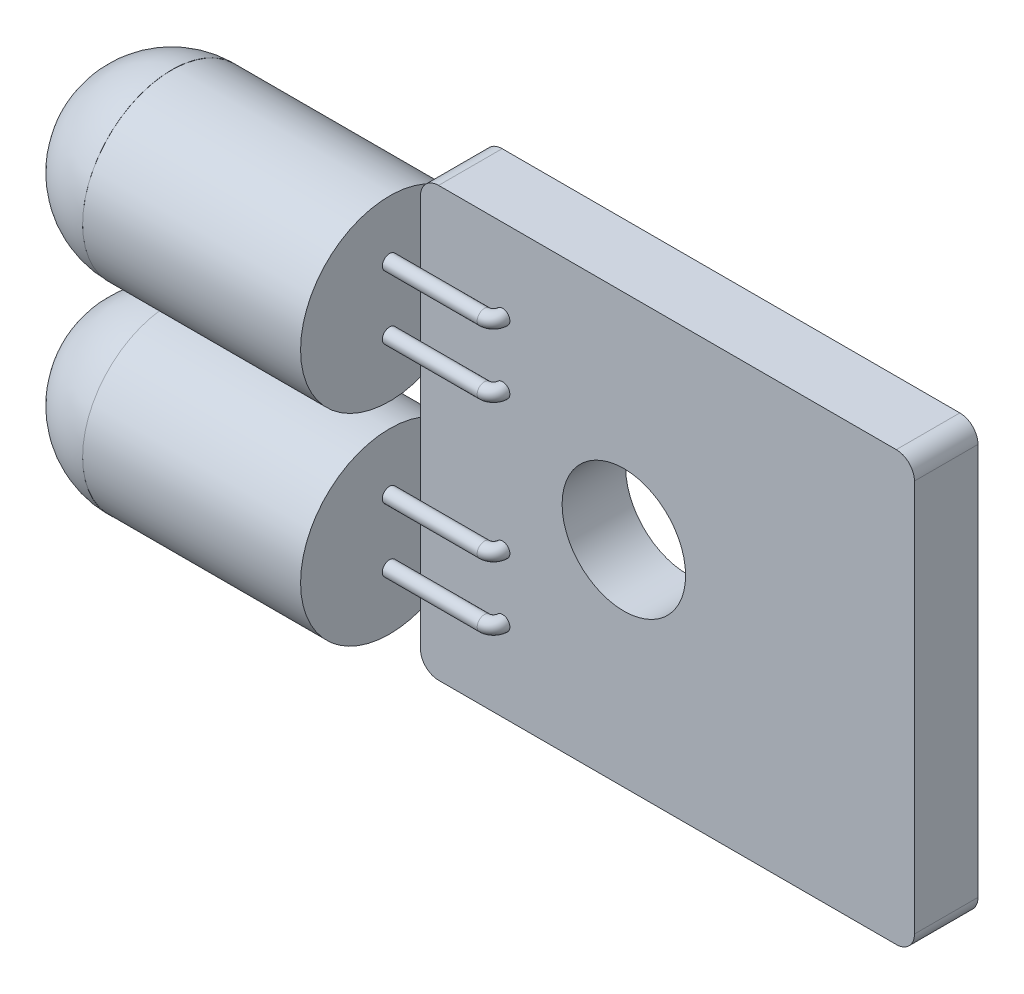
ISO-10303-21;
HEADER;
FILE_DESCRIPTION(('STEP AP214'),'2;1');
FILE_NAME('part.step','',(''),(''),'','','');
FILE_SCHEMA(('AUTOMOTIVE_DESIGN { 1 0 10303 214 1 1 1 1 }'));
ENDSEC;
DATA;
#1=APPLICATION_CONTEXT('core data for automotive mechanical design processes');
#2=APPLICATION_PROTOCOL_DEFINITION('international standard','automotive_design',2000,#1);
#3=PRODUCT_CONTEXT('',#1,'mechanical');
#4=PRODUCT('Part','Part','',(#3));
#5=PRODUCT_RELATED_PRODUCT_CATEGORY('part','',(#4));
#6=PRODUCT_DEFINITION_FORMATION('','',#4);
#7=PRODUCT_DEFINITION_CONTEXT('part definition',#1,'design');
#8=PRODUCT_DEFINITION('design','',#6,#7);
#9=PRODUCT_DEFINITION_SHAPE('','',#8);
#10=(LENGTH_UNIT() NAMED_UNIT(*) SI_UNIT(.MILLI.,.METRE.));
#11=(NAMED_UNIT(*) PLANE_ANGLE_UNIT() SI_UNIT($,.RADIAN.));
#12=(NAMED_UNIT(*) SI_UNIT($,.STERADIAN.) SOLID_ANGLE_UNIT());
#13=UNCERTAINTY_MEASURE_WITH_UNIT(LENGTH_MEASURE(1.E-05),#10,'distance_accuracy_value','');
#14=(GEOMETRIC_REPRESENTATION_CONTEXT(3) GLOBAL_UNCERTAINTY_ASSIGNED_CONTEXT((#13)) GLOBAL_UNIT_ASSIGNED_CONTEXT((#10,
#11,#12)) REPRESENTATION_CONTEXT('',''));
#15=CARTESIAN_POINT('',(0.,0.,0.));
#16=DIRECTION('',(0.,0.,1.));
#17=DIRECTION('',(1.,0.,0.));
#18=AXIS2_PLACEMENT_3D('',#15,#16,#17);
#19=CARTESIAN_POINT('',(-6.6,-3.12,-0.450000000000001));
#20=DIRECTION('',(-1.,0.,0.));
#21=DIRECTION('',(0.,-1.,0.));
#22=AXIS2_PLACEMENT_3D('',#19,#20,#21);
#23=PLANE('',#22);
#24=CARTESIAN_POINT('',(-6.6,-3.12,2.));
#25=DIRECTION('',(1.,0.,0.));
#26=DIRECTION('',(0.,1.,0.));
#27=AXIS2_PLACEMENT_3D('',#24,#25,#26);
#28=CIRCLE('',#27,2.45);
#29=CARTESIAN_POINT('',(-6.6,-0.67,2.));
#30=VERTEX_POINT('',#29);
#31=EDGE_CURVE('E12',#30,#30,#28,.T.);
#32=ORIENTED_EDGE('',*,*,#31,.T.);
#33=EDGE_LOOP('',(#32));
#34=FACE_BOUND('',#33,.T.);
#35=ADVANCED_FACE('F73',(#34),#23,.F.);
#36=CARTESIAN_POINT('',(-6.6,-3.12,2.));
#37=DIRECTION('',(1.,0.,0.));
#38=DIRECTION('',(0.,0.,-1.));
#39=AXIS2_PLACEMENT_3D('',#36,#37,#38);
#40=SPHERICAL_SURFACE('',#39,2.45);
#41=ORIENTED_EDGE('',*,*,#31,.F.);
#42=EDGE_LOOP('',(#41));
#43=FACE_BOUND('',#42,.T.);
#44=ADVANCED_FACE('F81',(#43),#40,.T.);
#45=CLOSED_SHELL('',(#35,#44));
#46=MANIFOLD_SOLID_BREP('B2',#45);
#47=CARTESIAN_POINT('',(-6.6,-8.675,2.));
#48=DIRECTION('',(1.,0.,0.));
#49=DIRECTION('',(0.,0.,-1.));
#50=AXIS2_PLACEMENT_3D('',#47,#48,#49);
#51=CYLINDRICAL_SURFACE('',#50,2.45);
#52=CARTESIAN_POINT('',(-6.6,-8.675,2.));
#53=DIRECTION('',(-1.,0.,0.));
#54=DIRECTION('',(0.,0.,1.));
#55=AXIS2_PLACEMENT_3D('',#52,#53,#54);
#56=CIRCLE('',#55,2.45);
#57=CARTESIAN_POINT('',(-6.6,-8.67750000000022,-0.449998724489465));
#58=VERTEX_POINT('',#57);
#59=CARTESIAN_POINT('',(-6.6,-8.67750000000022,4.44999872448946));
#60=VERTEX_POINT('',#59);
#61=EDGE_CURVE('E273',#58,#60,#56,.T.);
#62=ORIENTED_EDGE('',*,*,#61,.F.);
#63=EDGE_CURVE('E268',#60,#58,#56,.T.);
#64=ORIENTED_EDGE('',*,*,#63,.F.);
#65=EDGE_LOOP('',(#62,#64));
#66=FACE_BOUND('',#65,.T.);
#67=CARTESIAN_POINT('',(-0.6,-8.675,2.));
#68=DIRECTION('',(-1.,0.,0.));
#69=DIRECTION('',(0.,0.,1.));
#70=AXIS2_PLACEMENT_3D('',#67,#68,#69);
#71=CIRCLE('',#70,2.45);
#72=CARTESIAN_POINT('',(-0.6,-8.675,4.45));
#73=VERTEX_POINT('',#72);
#74=EDGE_CURVE('E269',#73,#73,#71,.T.);
#75=ORIENTED_EDGE('',*,*,#74,.T.);
#76=EDGE_LOOP('',(#75));
#77=FACE_BOUND('',#76,.T.);
#78=ADVANCED_FACE('F123',(#66,#77),#51,.T.);
#79=CARTESIAN_POINT('',(-6.6,-8.675,2.));
#80=DIRECTION('',(-1.,0.,0.));
#81=DIRECTION('',(0.,0.,1.));
#82=AXIS2_PLACEMENT_3D('',#79,#80,#81);
#83=PLANE('',#82);
#84=ORIENTED_EDGE('',*,*,#63,.T.);
#85=CARTESIAN_POINT('',(-6.6,-8.68,2.));
#86=DIRECTION('',(-1.,0.,0.));
#87=DIRECTION('',(0.,-1.,0.));
#88=AXIS2_PLACEMENT_3D('',#85,#86,#87);
#89=CIRCLE('',#88,2.45);
#90=EDGE_CURVE('E265',#60,#58,#89,.T.);
#91=ORIENTED_EDGE('',*,*,#90,.F.);
#92=EDGE_LOOP('',(#84,#91));
#93=FACE_BOUND('',#92,.T.);
#94=ADVANCED_FACE('F347',(#93),#83,.T.);
#95=CARTESIAN_POINT('',(-0.6,-8.675,2.));
#96=DIRECTION('',(-1.,0.,0.));
#97=DIRECTION('',(0.,0.,1.));
#98=AXIS2_PLACEMENT_3D('',#95,#96,#97);
#99=PLANE('',#98);
#100=CARTESIAN_POINT('',(-0.599999999999999,-9.55,2.));
#101=DIRECTION('',(1.,0.,0.));
#102=DIRECTION('',(0.,0.,1.));
#103=AXIS2_PLACEMENT_3D('',#100,#101,#102);
#104=CIRCLE('',#103,0.2);
#105=CARTESIAN_POINT('',(-0.599999999999999,-9.55,2.2));
#106=VERTEX_POINT('',#105);
#107=EDGE_CURVE('E249',#106,#106,#104,.T.);
#108=ORIENTED_EDGE('',*,*,#107,.F.);
#109=EDGE_LOOP('',(#108));
#110=FACE_BOUND('',#109,.T.);
#111=CARTESIAN_POINT('',(-0.599999999999999,-7.8,2.));
#112=DIRECTION('',(1.,0.,0.));
#113=DIRECTION('',(0.,0.,1.));
#114=AXIS2_PLACEMENT_3D('',#111,#112,#113);
#115=CIRCLE('',#114,0.2);
#116=CARTESIAN_POINT('',(-0.599999999999999,-7.8,2.2));
#117=VERTEX_POINT('',#116);
#118=EDGE_CURVE('E258',#117,#117,#115,.T.);
#119=ORIENTED_EDGE('',*,*,#118,.F.);
#120=EDGE_LOOP('',(#119));
#121=FACE_BOUND('',#120,.T.);
#122=ORIENTED_EDGE('',*,*,#74,.F.);
#123=EDGE_LOOP('',(#122));
#124=FACE_BOUND('',#123,.T.);
#125=ADVANCED_FACE('F353',(#110,#121,#124),#99,.F.);
#126=CARTESIAN_POINT('',(-6.6,-8.68,-0.450000000000001));
#127=DIRECTION('',(-1.,0.,0.));
#128=DIRECTION('',(0.,1.,0.));
#129=AXIS2_PLACEMENT_3D('',#126,#127,#128);
#130=PLANE('',#129);
#131=EDGE_CURVE('E264',#58,#60,#89,.T.);
#132=ORIENTED_EDGE('',*,*,#131,.F.);
#133=ORIENTED_EDGE('',*,*,#61,.T.);
#134=EDGE_LOOP('',(#132,#133));
#135=FACE_BOUND('',#134,.T.);
#136=ADVANCED_FACE('F363',(#135),#130,.F.);
#137=CARTESIAN_POINT('',(-6.6,-8.68,2.));
#138=DIRECTION('',(1.,0.,0.));
#139=DIRECTION('',(0.,0.,-1.));
#140=AXIS2_PLACEMENT_3D('',#137,#138,#139);
#141=SPHERICAL_SURFACE('',#140,2.45);
#142=ORIENTED_EDGE('',*,*,#90,.T.);
#143=ORIENTED_EDGE('',*,*,#131,.T.);
#144=EDGE_LOOP('',(#142,#143));
#145=FACE_BOUND('',#144,.T.);
#146=ADVANCED_FACE('F360',(#145),#141,.T.);
#147=CARTESIAN_POINT('',(2.01207420711359,-7.8,1.75));
#148=DIRECTION('',(0.,1.,0.));
#149=DIRECTION('',(1.,0.,0.));
#150=AXIS2_PLACEMENT_3D('',#147,#148,#149);
#151=TOROIDAL_SURFACE('',#150,0.25,0.2);
#152=CARTESIAN_POINT('',(2.01207420711359,-7.8,2.));
#153=DIRECTION('',(1.,0.,0.));
#154=DIRECTION('',(0.,0.,1.));
#155=AXIS2_PLACEMENT_3D('',#152,#153,#154);
#156=CIRCLE('',#155,0.2);
#157=CARTESIAN_POINT('',(2.01207420711359,-7.8,2.2));
#158=VERTEX_POINT('',#157);
#159=EDGE_CURVE('E261',#158,#158,#156,.T.);
#160=CARTESIAN_POINT('',(2.26207420711359,-7.8,1.75));
#161=DIRECTION('',(0.,0.,-1.));
#162=DIRECTION('',(1.,0.,0.));
#163=AXIS2_PLACEMENT_3D('',#160,#161,#162);
#164=CIRCLE('',#163,0.2);
#165=CARTESIAN_POINT('',(2.46207420711359,-7.8,1.75));
#166=VERTEX_POINT('',#165);
#167=EDGE_CURVE('E255',#166,#166,#164,.T.);
#168=CARTESIAN_POINT('',(2.01207420711359,-7.8,1.75));
#169=DIRECTION('',(0.,1.,0.));
#170=DIRECTION('',(1.,0.,0.));
#171=AXIS2_PLACEMENT_3D('',#168,#169,#170);
#172=CIRCLE('',#171,0.45);
#173=EDGE_CURVE('',#158,#166,#172,.T.);
#174=ORIENTED_EDGE('',*,*,#159,.T.);
#175=ORIENTED_EDGE('',*,*,#167,.F.);
#176=ORIENTED_EDGE('',*,*,#173,.T.);
#177=ORIENTED_EDGE('',*,*,#173,.F.);
#178=EDGE_LOOP('',(#174,#176,#175,#177));
#179=FACE_BOUND('',#178,.T.);
#180=ADVANCED_FACE('F379',(#179),#151,.T.);
#181=CARTESIAN_POINT('',(2.01207420711359,-7.8,2.));
#182=DIRECTION('',(-1.,0.,0.));
#183=DIRECTION('',(0.,0.,1.));
#184=AXIS2_PLACEMENT_3D('',#181,#182,#183);
#185=CYLINDRICAL_SURFACE('',#184,0.2);
#186=ORIENTED_EDGE('',*,*,#118,.T.);
#187=EDGE_LOOP('',(#186));
#188=FACE_BOUND('',#187,.T.);
#189=ORIENTED_EDGE('',*,*,#159,.F.);
#190=EDGE_LOOP('',(#189));
#191=FACE_BOUND('',#190,.T.);
#192=ADVANCED_FACE('F375',(#188,#191),#185,.T.);
#193=CARTESIAN_POINT('',(2.01207420711359,-9.55,1.75));
#194=DIRECTION('',(0.,1.,0.));
#195=DIRECTION('',(1.,0.,0.));
#196=AXIS2_PLACEMENT_3D('',#193,#194,#195);
#197=TOROIDAL_SURFACE('',#196,0.25,0.2);
#198=CARTESIAN_POINT('',(2.01207420711359,-9.55,2.));
#199=DIRECTION('',(1.,0.,0.));
#200=DIRECTION('',(0.,0.,1.));
#201=AXIS2_PLACEMENT_3D('',#198,#199,#200);
#202=CIRCLE('',#201,0.2);
#203=CARTESIAN_POINT('',(2.01207420711359,-9.55,2.2));
#204=VERTEX_POINT('',#203);
#205=EDGE_CURVE('E252',#204,#204,#202,.T.);
#206=CARTESIAN_POINT('',(2.26207420711359,-9.55,1.75));
#207=DIRECTION('',(0.,0.,-1.));
#208=DIRECTION('',(1.,0.,0.));
#209=AXIS2_PLACEMENT_3D('',#206,#207,#208);
#210=CIRCLE('',#209,0.2);
#211=CARTESIAN_POINT('',(2.46207420711359,-9.55,1.75));
#212=VERTEX_POINT('',#211);
#213=EDGE_CURVE('E246',#212,#212,#210,.T.);
#214=CARTESIAN_POINT('',(2.01207420711359,-9.55,1.75));
#215=DIRECTION('',(0.,1.,0.));
#216=DIRECTION('',(1.,0.,0.));
#217=AXIS2_PLACEMENT_3D('',#214,#215,#216);
#218=CIRCLE('',#217,0.45);
#219=EDGE_CURVE('',#204,#212,#218,.T.);
#220=ORIENTED_EDGE('',*,*,#205,.T.);
#221=ORIENTED_EDGE('',*,*,#213,.F.);
#222=ORIENTED_EDGE('',*,*,#219,.T.);
#223=ORIENTED_EDGE('',*,*,#219,.F.);
#224=EDGE_LOOP('',(#220,#222,#221,#223));
#225=FACE_BOUND('',#224,.T.);
#226=ADVANCED_FACE('F378',(#225),#197,.T.);
#227=CARTESIAN_POINT('',(2.01207420711359,-9.55,2.));
#228=DIRECTION('',(-1.,0.,0.));
#229=DIRECTION('',(0.,1.,0.));
#230=AXIS2_PLACEMENT_3D('',#227,#228,#229);
#231=CYLINDRICAL_SURFACE('',#230,0.2);
#232=ORIENTED_EDGE('',*,*,#107,.T.);
#233=EDGE_LOOP('',(#232));
#234=FACE_BOUND('',#233,.T.);
#235=ORIENTED_EDGE('',*,*,#205,.F.);
#236=EDGE_LOOP('',(#235));
#237=FACE_BOUND('',#236,.T.);
#238=ADVANCED_FACE('F419',(#234,#237),#231,.T.);
#239=CARTESIAN_POINT('',(0.,0.,1.75));
#240=DIRECTION('',(1.,0.,0.));
#241=DIRECTION('',(0.,1.,0.));
#242=AXIS2_PLACEMENT_3D('',#239,#240,#241);
#243=PLANE('',#242);
#244=DIRECTION('',(0.,-1.,0.));
#245=VECTOR('',#244,1.);
#246=CARTESIAN_POINT('',(0.,0.,1.75));
#247=LINE('',#246,#245);
#248=CARTESIAN_POINT('',(0.,-0.5,1.75));
#249=VERTEX_POINT('',#248);
#250=CARTESIAN_POINT('',(0.,-11.3,1.75));
#251=VERTEX_POINT('',#250);
#252=EDGE_CURVE('E220',#249,#251,#247,.T.);
#253=ORIENTED_EDGE('',*,*,#252,.F.);
#254=DIRECTION('',(0.,0.,-1.));
#255=VECTOR('',#254,1.);
#256=CARTESIAN_POINT('',(0.,-0.5,1.75));
#257=LINE('',#256,#255);
#258=CARTESIAN_POINT('',(0.,-0.5,0.));
#259=VERTEX_POINT('',#258);
#260=EDGE_CURVE('E302',#249,#259,#257,.T.);
#261=ORIENTED_EDGE('',*,*,#260,.T.);
#262=DIRECTION('',(0.,-1.,0.));
#263=VECTOR('',#262,1.);
#264=CARTESIAN_POINT('',(0.,0.,0.));
#265=LINE('',#264,#263);
#266=CARTESIAN_POINT('',(0.,-11.3,0.));
#267=VERTEX_POINT('',#266);
#268=EDGE_CURVE('E219',#259,#267,#265,.T.);
#269=ORIENTED_EDGE('',*,*,#268,.T.);
#270=DIRECTION('',(0.,0.,-1.));
#271=VECTOR('',#270,1.);
#272=CARTESIAN_POINT('',(0.,-11.3,1.75));
#273=LINE('',#272,#271);
#274=EDGE_CURVE('E300',#267,#251,#273,.F.);
#275=ORIENTED_EDGE('',*,*,#274,.T.);
#276=EDGE_LOOP('',(#253,#261,#269,#275));
#277=FACE_BOUND('',#276,.T.);
#278=ADVANCED_FACE('F308',(#277),#243,.F.);
#279=CARTESIAN_POINT('',(0.,-11.8,1.75));
#280=DIRECTION('',(0.,1.,0.));
#281=DIRECTION('',(0.,0.,1.));
#282=AXIS2_PLACEMENT_3D('',#279,#280,#281);
#283=PLANE('',#282);
#284=DIRECTION('',(1.,0.,0.));
#285=VECTOR('',#284,1.);
#286=CARTESIAN_POINT('',(0.,-11.8,1.75));
#287=LINE('',#286,#285);
#288=CARTESIAN_POINT('',(0.500000000000001,-11.8,1.75));
#289=VERTEX_POINT('',#288);
#290=CARTESIAN_POINT('',(13.1,-11.8,1.75));
#291=VERTEX_POINT('',#290);
#292=EDGE_CURVE('E222',#289,#291,#287,.T.);
#293=ORIENTED_EDGE('',*,*,#292,.F.);
#294=DIRECTION('',(0.,0.,-1.));
#295=VECTOR('',#294,1.);
#296=CARTESIAN_POINT('',(0.500000000000001,-11.8,1.75));
#297=LINE('',#296,#295);
#298=CARTESIAN_POINT('',(0.500000000000001,-11.8,0.));
#299=VERTEX_POINT('',#298);
#300=EDGE_CURVE('E71',#289,#299,#297,.T.);
#301=ORIENTED_EDGE('',*,*,#300,.T.);
#302=DIRECTION('',(1.,0.,0.));
#303=VECTOR('',#302,1.);
#304=CARTESIAN_POINT('',(0.,-11.8,0.));
#305=LINE('',#304,#303);
#306=CARTESIAN_POINT('',(13.1,-11.8,0.));
#307=VERTEX_POINT('',#306);
#308=EDGE_CURVE('E234',#299,#307,#305,.T.);
#309=ORIENTED_EDGE('',*,*,#308,.T.);
#310=DIRECTION('',(0.,0.,-1.));
#311=VECTOR('',#310,1.);
#312=CARTESIAN_POINT('',(13.1,-11.8,1.75));
#313=LINE('',#312,#311);
#314=EDGE_CURVE('E131',#307,#291,#313,.F.);
#315=ORIENTED_EDGE('',*,*,#314,.T.);
#316=EDGE_LOOP('',(#293,#301,#309,#315));
#317=FACE_BOUND('',#316,.T.);
#318=ADVANCED_FACE('F319',(#317),#283,.F.);
#319=CARTESIAN_POINT('',(13.6,0.,1.75));
#320=DIRECTION('',(-1.,0.,0.));
#321=DIRECTION('',(0.,0.,1.));
#322=AXIS2_PLACEMENT_3D('',#319,#320,#321);
#323=PLANE('',#322);
#324=DIRECTION('',(0.,1.,0.));
#325=VECTOR('',#324,1.);
#326=CARTESIAN_POINT('',(13.6,0.,0.));
#327=LINE('',#326,#325);
#328=CARTESIAN_POINT('',(13.6,-11.3,0.));
#329=VERTEX_POINT('',#328);
#330=CARTESIAN_POINT('',(13.6,-0.5,0.));
#331=VERTEX_POINT('',#330);
#332=EDGE_CURVE('E236',#329,#331,#327,.T.);
#333=ORIENTED_EDGE('',*,*,#332,.T.);
#334=DIRECTION('',(0.,0.,-1.));
#335=VECTOR('',#334,1.);
#336=CARTESIAN_POINT('',(13.6,-0.5,1.75));
#337=LINE('',#336,#335);
#338=CARTESIAN_POINT('',(13.6,-0.5,1.75));
#339=VERTEX_POINT('',#338);
#340=EDGE_CURVE('E291',#331,#339,#337,.F.);
#341=ORIENTED_EDGE('',*,*,#340,.T.);
#342=DIRECTION('',(0.,1.,0.));
#343=VECTOR('',#342,1.);
#344=CARTESIAN_POINT('',(13.6,0.,1.75));
#345=LINE('',#344,#343);
#346=CARTESIAN_POINT('',(13.6,-11.3,1.75));
#347=VERTEX_POINT('',#346);
#348=EDGE_CURVE('E225',#347,#339,#345,.T.);
#349=ORIENTED_EDGE('',*,*,#348,.F.);
#350=DIRECTION('',(0.,0.,-1.));
#351=VECTOR('',#350,1.);
#352=CARTESIAN_POINT('',(13.6,-11.3,1.75));
#353=LINE('',#352,#351);
#354=EDGE_CURVE('E288',#347,#329,#353,.T.);
#355=ORIENTED_EDGE('',*,*,#354,.T.);
#356=EDGE_LOOP('',(#333,#341,#349,#355));
#357=FACE_BOUND('',#356,.T.);
#358=ADVANCED_FACE('F327',(#357),#323,.F.);
#359=CARTESIAN_POINT('',(0.,0.,1.75));
#360=DIRECTION('',(0.,-1.,0.));
#361=DIRECTION('',(0.,0.,-1.));
#362=AXIS2_PLACEMENT_3D('',#359,#360,#361);
#363=PLANE('',#362);
#364=DIRECTION('',(-1.,0.,0.));
#365=VECTOR('',#364,1.);
#366=CARTESIAN_POINT('',(0.,0.,1.75));
#367=LINE('',#366,#365);
#368=CARTESIAN_POINT('',(13.1,0.,1.75));
#369=VERTEX_POINT('',#368);
#370=CARTESIAN_POINT('',(0.5,0.,1.75));
#371=VERTEX_POINT('',#370);
#372=EDGE_CURVE('E228',#369,#371,#367,.T.);
#373=ORIENTED_EDGE('',*,*,#372,.F.);
#374=DIRECTION('',(0.,0.,-1.));
#375=VECTOR('',#374,1.);
#376=CARTESIAN_POINT('',(13.1,0.,1.75));
#377=LINE('',#376,#375);
#378=CARTESIAN_POINT('',(13.1,0.,0.));
#379=VERTEX_POINT('',#378);
#380=EDGE_CURVE('E277',#369,#379,#377,.T.);
#381=ORIENTED_EDGE('',*,*,#380,.T.);
#382=DIRECTION('',(-1.,0.,0.));
#383=VECTOR('',#382,1.);
#384=CARTESIAN_POINT('',(0.,0.,0.));
#385=LINE('',#384,#383);
#386=CARTESIAN_POINT('',(0.5,0.,0.));
#387=VERTEX_POINT('',#386);
#388=EDGE_CURVE('E223',#379,#387,#385,.T.);
#389=ORIENTED_EDGE('',*,*,#388,.T.);
#390=DIRECTION('',(0.,0.,-1.));
#391=VECTOR('',#390,1.);
#392=CARTESIAN_POINT('',(0.5,0.,1.75));
#393=LINE('',#392,#391);
#394=EDGE_CURVE('E272',#387,#371,#393,.F.);
#395=ORIENTED_EDGE('',*,*,#394,.T.);
#396=EDGE_LOOP('',(#373,#381,#389,#395));
#397=FACE_BOUND('',#396,.T.);
#398=ADVANCED_FACE('F335',(#397),#363,.F.);
#399=CARTESIAN_POINT('',(0.,0.,1.75));
#400=DIRECTION('',(0.,0.,1.));
#401=DIRECTION('',(1.,0.,0.));
#402=AXIS2_PLACEMENT_3D('',#399,#400,#401);
#403=PLANE('',#402);
#404=ORIENTED_EDGE('',*,*,#213,.T.);
#405=EDGE_LOOP('',(#404));
#406=FACE_BOUND('',#405,.T.);
#407=ORIENTED_EDGE('',*,*,#167,.T.);
#408=EDGE_LOOP('',(#407));
#409=FACE_BOUND('',#408,.T.);
#410=CARTESIAN_POINT('',(2.26207420711359,-2.25,1.75));
#411=DIRECTION('',(0.,0.,1.));
#412=DIRECTION('',(1.,0.,0.));
#413=AXIS2_PLACEMENT_3D('',#410,#411,#412);
#414=CIRCLE('',#413,0.2);
#415=CARTESIAN_POINT('',(2.46207420711359,-2.25,1.75));
#416=VERTEX_POINT('',#415);
#417=EDGE_CURVE('E243',#416,#416,#414,.T.);
#418=ORIENTED_EDGE('',*,*,#417,.F.);
#419=EDGE_LOOP('',(#418));
#420=FACE_BOUND('',#419,.T.);
#421=CARTESIAN_POINT('',(2.26207420711359,-4.,1.75));
#422=DIRECTION('',(0.,0.,1.));
#423=DIRECTION('',(1.,0.,0.));
#424=AXIS2_PLACEMENT_3D('',#421,#422,#423);
#425=CIRCLE('',#424,0.2);
#426=CARTESIAN_POINT('',(2.46207420711359,-4.,1.75));
#427=VERTEX_POINT('',#426);
#428=EDGE_CURVE('E231',#427,#427,#425,.T.);
#429=ORIENTED_EDGE('',*,*,#428,.F.);
#430=EDGE_LOOP('',(#429));
#431=FACE_BOUND('',#430,.T.);
#432=CARTESIAN_POINT('',(5.6,-5.9,1.75));
#433=DIRECTION('',(0.,0.,1.));
#434=DIRECTION('',(1.,0.,0.));
#435=AXIS2_PLACEMENT_3D('',#432,#433,#434);
#436=CIRCLE('',#435,1.7);
#437=CARTESIAN_POINT('',(7.3,-5.9,1.75));
#438=VERTEX_POINT('',#437);
#439=EDGE_CURVE('E216',#438,#438,#436,.T.);
#440=ORIENTED_EDGE('',*,*,#439,.F.);
#441=EDGE_LOOP('',(#440));
#442=FACE_BOUND('',#441,.T.);
#443=ORIENTED_EDGE('',*,*,#348,.T.);
#444=CARTESIAN_POINT('',(13.1,-0.5,1.75));
#445=DIRECTION('',(0.,0.,1.));
#446=DIRECTION('',(1.,0.,0.));
#447=AXIS2_PLACEMENT_3D('',#444,#445,#446);
#448=CIRCLE('',#447,0.5);
#449=EDGE_CURVE('E298',#339,#369,#448,.T.);
#450=ORIENTED_EDGE('',*,*,#449,.T.);
#451=ORIENTED_EDGE('',*,*,#372,.T.);
#452=CARTESIAN_POINT('',(0.5,-0.5,1.75));
#453=DIRECTION('',(0.,0.,1.));
#454=DIRECTION('',(1.,0.,0.));
#455=AXIS2_PLACEMENT_3D('',#452,#453,#454);
#456=CIRCLE('',#455,0.5);
#457=EDGE_CURVE('E296',#371,#249,#456,.T.);
#458=ORIENTED_EDGE('',*,*,#457,.T.);
#459=ORIENTED_EDGE('',*,*,#252,.T.);
#460=CARTESIAN_POINT('',(0.500000000000001,-11.3,1.75));
#461=DIRECTION('',(0.,0.,1.));
#462=DIRECTION('',(1.,0.,0.));
#463=AXIS2_PLACEMENT_3D('',#460,#461,#462);
#464=CIRCLE('',#463,0.5);
#465=EDGE_CURVE('E144',#251,#289,#464,.T.);
#466=ORIENTED_EDGE('',*,*,#465,.T.);
#467=ORIENTED_EDGE('',*,*,#292,.T.);
#468=CARTESIAN_POINT('',(13.1,-11.3,1.75));
#469=DIRECTION('',(0.,0.,1.));
#470=DIRECTION('',(1.,0.,0.));
#471=AXIS2_PLACEMENT_3D('',#468,#469,#470);
#472=CIRCLE('',#471,0.5);
#473=EDGE_CURVE('E293',#291,#347,#472,.T.);
#474=ORIENTED_EDGE('',*,*,#473,.T.);
#475=EDGE_LOOP('',(#443,#450,#451,#458,#459,#466,#467,#474));
#476=FACE_BOUND('',#475,.T.);
#477=ADVANCED_FACE('F321',(#406,#409,#420,#431,#442,#476),#403,.T.);
#478=CARTESIAN_POINT('',(0.,0.,0.));
#479=DIRECTION('',(0.,0.,1.));
#480=DIRECTION('',(1.,0.,0.));
#481=AXIS2_PLACEMENT_3D('',#478,#479,#480);
#482=PLANE('',#481);
#483=CARTESIAN_POINT('',(5.6,-5.9,0.));
#484=DIRECTION('',(0.,0.,-1.));
#485=DIRECTION('',(-1.,0.,0.));
#486=AXIS2_PLACEMENT_3D('',#483,#484,#485);
#487=CIRCLE('',#486,1.7);
#488=CARTESIAN_POINT('',(3.9,-5.9,0.));
#489=VERTEX_POINT('',#488);
#490=EDGE_CURVE('E213',#489,#489,#487,.T.);
#491=ORIENTED_EDGE('',*,*,#490,.F.);
#492=EDGE_LOOP('',(#491));
#493=FACE_BOUND('',#492,.T.);
#494=ORIENTED_EDGE('',*,*,#388,.F.);
#495=CARTESIAN_POINT('',(13.1,-0.5,0.));
#496=DIRECTION('',(0.,0.,1.));
#497=DIRECTION('',(1.,0.,0.));
#498=AXIS2_PLACEMENT_3D('',#495,#496,#497);
#499=CIRCLE('',#498,0.5);
#500=EDGE_CURVE('E286',#379,#331,#499,.F.);
#501=ORIENTED_EDGE('',*,*,#500,.T.);
#502=ORIENTED_EDGE('',*,*,#332,.F.);
#503=CARTESIAN_POINT('',(13.1,-11.3,0.));
#504=DIRECTION('',(0.,0.,1.));
#505=DIRECTION('',(1.,0.,0.));
#506=AXIS2_PLACEMENT_3D('',#503,#504,#505);
#507=CIRCLE('',#506,0.5);
#508=EDGE_CURVE('E280',#329,#307,#507,.F.);
#509=ORIENTED_EDGE('',*,*,#508,.T.);
#510=ORIENTED_EDGE('',*,*,#308,.F.);
#511=CARTESIAN_POINT('',(0.500000000000001,-11.3,0.));
#512=DIRECTION('',(0.,0.,1.));
#513=DIRECTION('',(1.,0.,0.));
#514=AXIS2_PLACEMENT_3D('',#511,#512,#513);
#515=CIRCLE('',#514,0.5);
#516=EDGE_CURVE('E282',#299,#267,#515,.F.);
#517=ORIENTED_EDGE('',*,*,#516,.T.);
#518=ORIENTED_EDGE('',*,*,#268,.F.);
#519=CARTESIAN_POINT('',(0.5,-0.5,0.));
#520=DIRECTION('',(0.,0.,1.));
#521=DIRECTION('',(1.,0.,0.));
#522=AXIS2_PLACEMENT_3D('',#519,#520,#521);
#523=CIRCLE('',#522,0.5);
#524=EDGE_CURVE('E284',#259,#387,#523,.F.);
#525=ORIENTED_EDGE('',*,*,#524,.T.);
#526=EDGE_LOOP('',(#494,#501,#502,#509,#510,#517,#518,#525));
#527=FACE_BOUND('',#526,.T.);
#528=ADVANCED_FACE('F314',(#493,#527),#482,.F.);
#529=CARTESIAN_POINT('',(5.6,-5.9,4.45));
#530=DIRECTION('',(0.,0.,-1.));
#531=DIRECTION('',(-1.,0.,0.));
#532=AXIS2_PLACEMENT_3D('',#529,#530,#531);
#533=CYLINDRICAL_SURFACE('',#532,1.7);
#534=ORIENTED_EDGE('',*,*,#439,.T.);
#535=EDGE_LOOP('',(#534));
#536=FACE_BOUND('',#535,.T.);
#537=ORIENTED_EDGE('',*,*,#490,.T.);
#538=EDGE_LOOP('',(#537));
#539=FACE_BOUND('',#538,.T.);
#540=ADVANCED_FACE('F398',(#536,#539),#533,.F.);
#541=CARTESIAN_POINT('',(-0.6,-4.,2.));
#542=DIRECTION('',(-1.,0.,0.));
#543=DIRECTION('',(0.,0.,1.));
#544=AXIS2_PLACEMENT_3D('',#541,#542,#543);
#545=PLANE('',#544);
#546=CARTESIAN_POINT('',(-0.6,-4.,2.));
#547=DIRECTION('',(-1.,0.,0.));
#548=DIRECTION('',(0.,0.,1.));
#549=AXIS2_PLACEMENT_3D('',#546,#547,#548);
#550=CIRCLE('',#549,0.2);
#551=CARTESIAN_POINT('',(-0.6,-4.,2.2));
#552=VERTEX_POINT('',#551);
#553=EDGE_CURVE('E207',#552,#552,#550,.T.);
#554=ORIENTED_EDGE('',*,*,#553,.T.);
#555=EDGE_LOOP('',(#554));
#556=FACE_BOUND('',#555,.T.);
#557=ADVANCED_FACE('F401',(#556),#545,.T.);
#558=CARTESIAN_POINT('',(2.01207420711359,-4.,1.75));
#559=DIRECTION('',(0.,-1.,0.));
#560=DIRECTION('',(1.,0.,0.));
#561=AXIS2_PLACEMENT_3D('',#558,#559,#560);
#562=TOROIDAL_SURFACE('',#561,0.25,0.2);
#563=CARTESIAN_POINT('',(2.01207420711359,-4.,2.));
#564=DIRECTION('',(-1.,0.,0.));
#565=DIRECTION('',(0.,0.,1.));
#566=AXIS2_PLACEMENT_3D('',#563,#564,#565);
#567=CIRCLE('',#566,0.2);
#568=CARTESIAN_POINT('',(2.01207420711359,-4.,2.2));
#569=VERTEX_POINT('',#568);
#570=EDGE_CURVE('E203',#569,#569,#567,.T.);
#571=CARTESIAN_POINT('',(2.01207420711359,-4.,1.75));
#572=DIRECTION('',(0.,-1.,0.));
#573=DIRECTION('',(1.,0.,0.));
#574=AXIS2_PLACEMENT_3D('',#571,#572,#573);
#575=CIRCLE('',#574,0.45);
#576=EDGE_CURVE('',#427,#569,#575,.T.);
#577=ORIENTED_EDGE('',*,*,#428,.T.);
#578=ORIENTED_EDGE('',*,*,#570,.F.);
#579=ORIENTED_EDGE('',*,*,#576,.T.);
#580=ORIENTED_EDGE('',*,*,#576,.F.);
#581=EDGE_LOOP('',(#577,#579,#578,#580));
#582=FACE_BOUND('',#581,.T.);
#583=ADVANCED_FACE('F516',(#582),#562,.T.);
#584=CARTESIAN_POINT('',(2.01207420711359,-4.,2.));
#585=DIRECTION('',(-1.,0.,0.));
#586=DIRECTION('',(0.,0.,1.));
#587=AXIS2_PLACEMENT_3D('',#584,#585,#586);
#588=CYLINDRICAL_SURFACE('',#587,0.2);
#589=ORIENTED_EDGE('',*,*,#553,.F.);
#590=EDGE_LOOP('',(#589));
#591=FACE_BOUND('',#590,.T.);
#592=ORIENTED_EDGE('',*,*,#570,.T.);
#593=EDGE_LOOP('',(#592));
#594=FACE_BOUND('',#593,.T.);
#595=ADVANCED_FACE('F403',(#591,#594),#588,.T.);
#596=CARTESIAN_POINT('',(-0.6,-2.25,2.));
#597=DIRECTION('',(-1.,0.,0.));
#598=DIRECTION('',(0.,0.,1.));
#599=AXIS2_PLACEMENT_3D('',#596,#597,#598);
#600=PLANE('',#599);
#601=CARTESIAN_POINT('',(-0.6,-2.25,2.));
#602=DIRECTION('',(-1.,0.,0.));
#603=DIRECTION('',(0.,0.,1.));
#604=AXIS2_PLACEMENT_3D('',#601,#602,#603);
#605=CIRCLE('',#604,0.2);
#606=CARTESIAN_POINT('',(-0.6,-2.25,2.2));
#607=VERTEX_POINT('',#606);
#608=EDGE_CURVE('E200',#607,#607,#605,.T.);
#609=ORIENTED_EDGE('',*,*,#608,.T.);
#610=EDGE_LOOP('',(#609));
#611=FACE_BOUND('',#610,.T.);
#612=ADVANCED_FACE('F201',(#611),#600,.T.);
#613=CARTESIAN_POINT('',(2.01207420711359,-2.25,1.75));
#614=DIRECTION('',(0.,-1.,0.));
#615=DIRECTION('',(1.,0.,0.));
#616=AXIS2_PLACEMENT_3D('',#613,#614,#615);
#617=TOROIDAL_SURFACE('',#616,0.25,0.2);
#618=CARTESIAN_POINT('',(2.01207420711359,-2.25,2.));
#619=DIRECTION('',(-1.,0.,0.));
#620=DIRECTION('',(0.,0.,1.));
#621=AXIS2_PLACEMENT_3D('',#618,#619,#620);
#622=CIRCLE('',#621,0.2);
#623=CARTESIAN_POINT('',(2.01207420711359,-2.25,2.2));
#624=VERTEX_POINT('',#623);
#625=EDGE_CURVE('E204',#624,#624,#622,.T.);
#626=CARTESIAN_POINT('',(2.01207420711359,-2.25,1.75));
#627=DIRECTION('',(0.,-1.,0.));
#628=DIRECTION('',(1.,0.,0.));
#629=AXIS2_PLACEMENT_3D('',#626,#627,#628);
#630=CIRCLE('',#629,0.45);
#631=EDGE_CURVE('',#416,#624,#630,.T.);
#632=ORIENTED_EDGE('',*,*,#417,.T.);
#633=ORIENTED_EDGE('',*,*,#625,.F.);
#634=ORIENTED_EDGE('',*,*,#631,.T.);
#635=ORIENTED_EDGE('',*,*,#631,.F.);
#636=EDGE_LOOP('',(#632,#634,#633,#635));
#637=FACE_BOUND('',#636,.T.);
#638=ADVANCED_FACE('F496',(#637),#617,.T.);
#639=CARTESIAN_POINT('',(2.01207420711359,-2.25,2.));
#640=DIRECTION('',(-1.,0.,0.));
#641=DIRECTION('',(0.,-1.,0.));
#642=AXIS2_PLACEMENT_3D('',#639,#640,#641);
#643=CYLINDRICAL_SURFACE('',#642,0.2);
#644=ORIENTED_EDGE('',*,*,#608,.F.);
#645=EDGE_LOOP('',(#644));
#646=FACE_BOUND('',#645,.T.);
#647=ORIENTED_EDGE('',*,*,#625,.T.);
#648=EDGE_LOOP('',(#647));
#649=FACE_BOUND('',#648,.T.);
#650=ADVANCED_FACE('F344',(#646,#649),#643,.T.);
#651=CARTESIAN_POINT('',(13.1,-0.5,1.75));
#652=DIRECTION('',(0.,0.,-1.));
#653=DIRECTION('',(-1.,0.,0.));
#654=AXIS2_PLACEMENT_3D('',#651,#652,#653);
#655=CYLINDRICAL_SURFACE('',#654,0.5);
#656=ORIENTED_EDGE('',*,*,#449,.F.);
#657=ORIENTED_EDGE('',*,*,#340,.F.);
#658=ORIENTED_EDGE('',*,*,#500,.F.);
#659=ORIENTED_EDGE('',*,*,#380,.F.);
#660=EDGE_LOOP('',(#656,#657,#658,#659));
#661=FACE_BOUND('',#660,.T.);
#662=ADVANCED_FACE('F332',(#661),#655,.T.);
#663=CARTESIAN_POINT('',(0.5,-0.5,1.75));
#664=DIRECTION('',(0.,0.,-1.));
#665=DIRECTION('',(-1.,0.,0.));
#666=AXIS2_PLACEMENT_3D('',#663,#664,#665);
#667=CYLINDRICAL_SURFACE('',#666,0.5);
#668=ORIENTED_EDGE('',*,*,#457,.F.);
#669=ORIENTED_EDGE('',*,*,#394,.F.);
#670=ORIENTED_EDGE('',*,*,#524,.F.);
#671=ORIENTED_EDGE('',*,*,#260,.F.);
#672=EDGE_LOOP('',(#668,#669,#670,#671));
#673=FACE_BOUND('',#672,.T.);
#674=ADVANCED_FACE('F337',(#673),#667,.T.);
#675=CARTESIAN_POINT('',(0.500000000000001,-11.3,1.75));
#676=DIRECTION('',(0.,0.,-1.));
#677=DIRECTION('',(-1.,0.,0.));
#678=AXIS2_PLACEMENT_3D('',#675,#676,#677);
#679=CYLINDRICAL_SURFACE('',#678,0.5);
#680=ORIENTED_EDGE('',*,*,#465,.F.);
#681=ORIENTED_EDGE('',*,*,#274,.F.);
#682=ORIENTED_EDGE('',*,*,#516,.F.);
#683=ORIENTED_EDGE('',*,*,#300,.F.);
#684=EDGE_LOOP('',(#680,#681,#682,#683));
#685=FACE_BOUND('',#684,.T.);
#686=ADVANCED_FACE('F318',(#685),#679,.T.);
#687=CARTESIAN_POINT('',(13.1,-11.3,1.75));
#688=DIRECTION('',(0.,0.,-1.));
#689=DIRECTION('',(-1.,0.,0.));
#690=AXIS2_PLACEMENT_3D('',#687,#688,#689);
#691=CYLINDRICAL_SURFACE('',#690,0.5);
#692=ORIENTED_EDGE('',*,*,#473,.F.);
#693=ORIENTED_EDGE('',*,*,#314,.F.);
#694=ORIENTED_EDGE('',*,*,#508,.F.);
#695=ORIENTED_EDGE('',*,*,#354,.F.);
#696=EDGE_LOOP('',(#692,#693,#694,#695));
#697=FACE_BOUND('',#696,.T.);
#698=ADVANCED_FACE('F125',(#697),#691,.T.);
#699=CLOSED_SHELL('',(#78,#94,#125,#136,#146,#180,#192,#226,#238,#278,#318,#358,#398,#477,#528,
#540,#557,#583,#595,#612,#638,#650,#662,#674,#686,#698));
#700=MANIFOLD_SOLID_BREP('B7',#699);
#701=CARTESIAN_POINT('',(-6.6,-3.125,2.));
#702=DIRECTION('',(1.,0.,0.));
#703=DIRECTION('',(0.,0.,-1.));
#704=AXIS2_PLACEMENT_3D('',#701,#702,#703);
#705=CYLINDRICAL_SURFACE('',#704,2.45);
#706=CARTESIAN_POINT('',(-6.6,-3.125,2.));
#707=DIRECTION('',(-1.,0.,0.));
#708=DIRECTION('',(0.,0.,1.));
#709=AXIS2_PLACEMENT_3D('',#706,#707,#708);
#710=CIRCLE('',#709,2.45);
#711=CARTESIAN_POINT('',(-6.6,-3.125,4.45));
#712=VERTEX_POINT('',#711);
#713=EDGE_CURVE('E122',#712,#712,#710,.T.);
#714=ORIENTED_EDGE('',*,*,#713,.F.);
#715=EDGE_LOOP('',(#714));
#716=FACE_BOUND('',#715,.T.);
#717=CARTESIAN_POINT('',(-0.6,-3.125,2.));
#718=DIRECTION('',(-1.,0.,0.));
#719=DIRECTION('',(0.,0.,1.));
#720=AXIS2_PLACEMENT_3D('',#717,#718,#719);
#721=CIRCLE('',#720,2.45);
#722=CARTESIAN_POINT('',(-0.6,-3.125,4.45));
#723=VERTEX_POINT('',#722);
#724=EDGE_CURVE('E643',#723,#723,#721,.T.);
#725=ORIENTED_EDGE('',*,*,#724,.T.);
#726=EDGE_LOOP('',(#725));
#727=FACE_BOUND('',#726,.T.);
#728=ADVANCED_FACE('F640',(#716,#727),#705,.T.);
#729=CARTESIAN_POINT('',(-6.6,-3.125,2.));
#730=DIRECTION('',(-1.,0.,0.));
#731=DIRECTION('',(0.,0.,1.));
#732=AXIS2_PLACEMENT_3D('',#729,#730,#731);
#733=PLANE('',#732);
#734=ORIENTED_EDGE('',*,*,#713,.T.);
#735=EDGE_LOOP('',(#734));
#736=FACE_BOUND('',#735,.T.);
#737=ADVANCED_FACE('F655',(#736),#733,.T.);
#738=CARTESIAN_POINT('',(-0.6,-3.125,2.));
#739=DIRECTION('',(-1.,0.,0.));
#740=DIRECTION('',(0.,0.,1.));
#741=AXIS2_PLACEMENT_3D('',#738,#739,#740);
#742=PLANE('',#741);
#743=ORIENTED_EDGE('',*,*,#724,.F.);
#744=EDGE_LOOP('',(#743));
#745=FACE_BOUND('',#744,.T.);
#746=ADVANCED_FACE('F653',(#745),#742,.F.);
#747=CLOSED_SHELL('',(#728,#737,#746));
#748=MANIFOLD_SOLID_BREP('B65',#747);
#749=ADVANCED_BREP_SHAPE_REPRESENTATION('',(#18,#46,#700,#748),#14);
#750=SHAPE_DEFINITION_REPRESENTATION(#9,#749);
ENDSEC;
END-ISO-10303-21;
